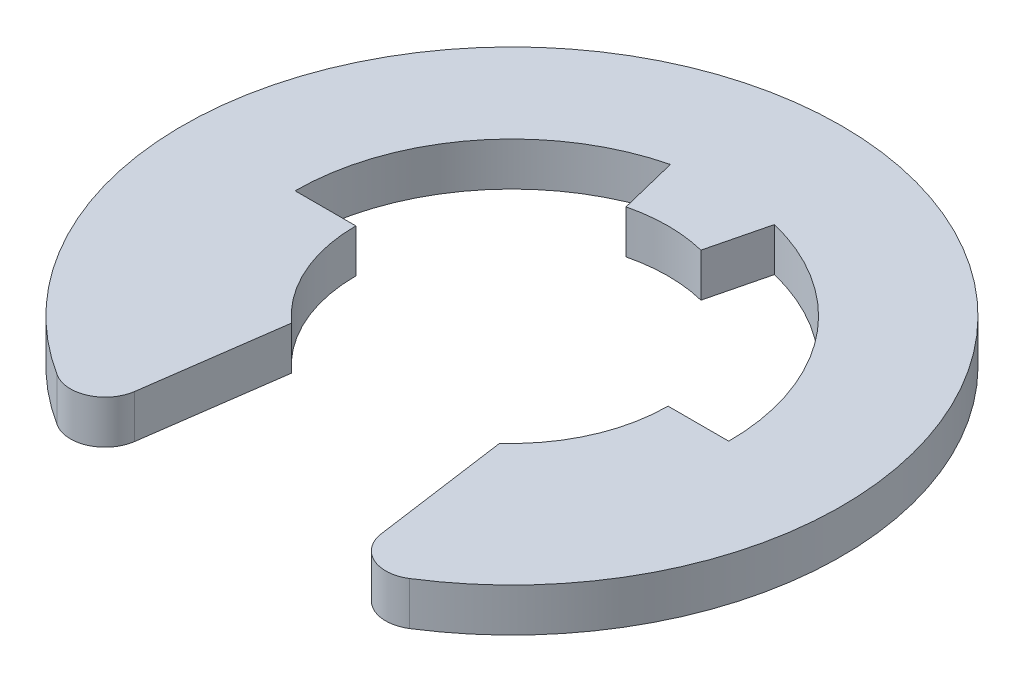
ISO-10303-21;
HEADER;
FILE_DESCRIPTION(('STEP AP214'),'2;1');
FILE_NAME('part.step','',(''),(''),'','','');
FILE_SCHEMA(('AUTOMOTIVE_DESIGN { 1 0 10303 214 1 1 1 1 }'));
ENDSEC;
DATA;
#1=APPLICATION_CONTEXT('core data for automotive mechanical design processes');
#2=APPLICATION_PROTOCOL_DEFINITION('international standard','automotive_design',2000,#1);
#3=PRODUCT_CONTEXT('',#1,'mechanical');
#4=PRODUCT('Part','Part','',(#3));
#5=PRODUCT_RELATED_PRODUCT_CATEGORY('part','',(#4));
#6=PRODUCT_DEFINITION_FORMATION('','',#4);
#7=PRODUCT_DEFINITION_CONTEXT('part definition',#1,'design');
#8=PRODUCT_DEFINITION('design','',#6,#7);
#9=PRODUCT_DEFINITION_SHAPE('','',#8);
#10=(LENGTH_UNIT() NAMED_UNIT(*) SI_UNIT(.MILLI.,.METRE.));
#11=(NAMED_UNIT(*) PLANE_ANGLE_UNIT() SI_UNIT($,.RADIAN.));
#12=(NAMED_UNIT(*) SI_UNIT($,.STERADIAN.) SOLID_ANGLE_UNIT());
#13=UNCERTAINTY_MEASURE_WITH_UNIT(LENGTH_MEASURE(1.E-05),#10,'distance_accuracy_value','');
#14=(GEOMETRIC_REPRESENTATION_CONTEXT(3) GLOBAL_UNCERTAINTY_ASSIGNED_CONTEXT((#13)) GLOBAL_UNIT_ASSIGNED_CONTEXT((#10,
#11,#12)) REPRESENTATION_CONTEXT('',''));
#15=CARTESIAN_POINT('',(0.,0.,0.));
#16=DIRECTION('',(0.,0.,1.));
#17=DIRECTION('',(1.,0.,0.));
#18=AXIS2_PLACEMENT_3D('',#15,#16,#17);
#19=CARTESIAN_POINT('',(0.,0.3175,0.));
#20=DIRECTION('',(0.,-1.,0.));
#21=DIRECTION('',(0.,0.,-1.));
#22=AXIS2_PLACEMENT_3D('',#19,#20,#21);
#23=CYLINDRICAL_SURFACE('',#22,2.286);
#24=CARTESIAN_POINT('',(0.,-0.3175,0.));
#25=DIRECTION('',(0.,-1.,0.));
#26=DIRECTION('',(0.,0.,1.));
#27=AXIS2_PLACEMENT_3D('',#24,#25,#26);
#28=CIRCLE('',#27,2.286);
#29=CARTESIAN_POINT('',(-1.524,-0.3175,1.70388379885484));
#30=VERTEX_POINT('',#29);
#31=CARTESIAN_POINT('',(-2.286,-0.3175,0.));
#32=VERTEX_POINT('',#31);
#33=EDGE_CURVE('E168',#30,#32,#28,.T.);
#34=ORIENTED_EDGE('',*,*,#33,.T.);
#35=DIRECTION('',(0.,-1.,0.));
#36=VECTOR('',#35,1.);
#37=CARTESIAN_POINT('',(-2.286,0.3175,0.));
#38=LINE('',#37,#36);
#39=CARTESIAN_POINT('',(-2.286,0.3175,0.));
#40=VERTEX_POINT('',#39);
#41=EDGE_CURVE('E151',#40,#32,#38,.T.);
#42=ORIENTED_EDGE('',*,*,#41,.F.);
#43=CARTESIAN_POINT('',(0.,0.3175,0.));
#44=DIRECTION('',(0.,-1.,0.));
#45=DIRECTION('',(0.,0.,1.));
#46=AXIS2_PLACEMENT_3D('',#43,#44,#45);
#47=CIRCLE('',#46,2.286);
#48=CARTESIAN_POINT('',(-1.524,0.3175,1.70388379885484));
#49=VERTEX_POINT('',#48);
#50=EDGE_CURVE('E157',#49,#40,#47,.T.);
#51=ORIENTED_EDGE('',*,*,#50,.F.);
#52=DIRECTION('',(0.,-1.,0.));
#53=VECTOR('',#52,1.);
#54=CARTESIAN_POINT('',(-1.524,0.3175,1.70388379885484));
#55=LINE('',#54,#53);
#56=EDGE_CURVE('E215',#49,#30,#55,.T.);
#57=ORIENTED_EDGE('',*,*,#56,.T.);
#58=EDGE_LOOP('',(#34,#42,#51,#57));
#59=FACE_BOUND('',#58,.T.);
#60=ADVANCED_FACE('F43',(#59),#23,.F.);
#61=CARTESIAN_POINT('',(-3.175,0.3175,0.));
#62=DIRECTION('',(0.,0.,1.));
#63=DIRECTION('',(1.,0.,0.));
#64=AXIS2_PLACEMENT_3D('',#61,#62,#63);
#65=PLANE('',#64);
#66=DIRECTION('',(-1.,0.,0.));
#67=VECTOR('',#66,1.);
#68=CARTESIAN_POINT('',(-3.175,-0.3175,0.));
#69=LINE('',#68,#67);
#70=CARTESIAN_POINT('',(-3.175,-0.3175,0.));
#71=VERTEX_POINT('',#70);
#72=EDGE_CURVE('E250',#32,#71,#69,.T.);
#73=ORIENTED_EDGE('',*,*,#72,.T.);
#74=DIRECTION('',(0.,-1.,0.));
#75=VECTOR('',#74,1.);
#76=CARTESIAN_POINT('',(-3.175,0.3175,0.));
#77=LINE('',#76,#75);
#78=CARTESIAN_POINT('',(-3.175,0.3175,0.));
#79=VERTEX_POINT('',#78);
#80=EDGE_CURVE('E154',#79,#71,#77,.T.);
#81=ORIENTED_EDGE('',*,*,#80,.F.);
#82=DIRECTION('',(-1.,0.,0.));
#83=VECTOR('',#82,1.);
#84=CARTESIAN_POINT('',(-3.175,0.3175,0.));
#85=LINE('',#84,#83);
#86=EDGE_CURVE('E147',#40,#79,#85,.T.);
#87=ORIENTED_EDGE('',*,*,#86,.F.);
#88=ORIENTED_EDGE('',*,*,#41,.T.);
#89=EDGE_LOOP('',(#73,#81,#87,#88));
#90=FACE_BOUND('',#89,.T.);
#91=ADVANCED_FACE('F149',(#90),#65,.F.);
#92=CARTESIAN_POINT('',(0.,0.3175,0.));
#93=DIRECTION('',(0.,-1.,0.));
#94=DIRECTION('',(0.,0.,-1.));
#95=AXIS2_PLACEMENT_3D('',#92,#93,#94);
#96=CYLINDRICAL_SURFACE('',#95,3.175);
#97=CARTESIAN_POINT('',(0.,-0.3175,0.));
#98=DIRECTION('',(0.,-1.,0.));
#99=DIRECTION('',(0.,0.,1.));
#100=AXIS2_PLACEMENT_3D('',#97,#98,#99);
#101=CIRCLE('',#100,3.175);
#102=CARTESIAN_POINT('',(-0.762,-0.3175,-3.08220391927595));
#103=VERTEX_POINT('',#102);
#104=EDGE_CURVE('E244',#71,#103,#101,.T.);
#105=ORIENTED_EDGE('',*,*,#104,.T.);
#106=DIRECTION('',(0.,-1.,0.));
#107=VECTOR('',#106,1.);
#108=CARTESIAN_POINT('',(-0.762,0.3175,-3.08220391927595));
#109=LINE('',#108,#107);
#110=CARTESIAN_POINT('',(-0.762,0.3175,-3.08220391927595));
#111=VERTEX_POINT('',#110);
#112=EDGE_CURVE('E173',#111,#103,#109,.T.);
#113=ORIENTED_EDGE('',*,*,#112,.F.);
#114=CARTESIAN_POINT('',(0.,0.3175,0.));
#115=DIRECTION('',(0.,-1.,0.));
#116=DIRECTION('',(0.,0.,1.));
#117=AXIS2_PLACEMENT_3D('',#114,#115,#116);
#118=CIRCLE('',#117,3.175);
#119=EDGE_CURVE('E156',#79,#111,#118,.T.);
#120=ORIENTED_EDGE('',*,*,#119,.F.);
#121=ORIENTED_EDGE('',*,*,#80,.T.);
#122=EDGE_LOOP('',(#105,#113,#120,#121));
#123=FACE_BOUND('',#122,.T.);
#124=ADVANCED_FACE('F275',(#123),#96,.F.);
#125=CARTESIAN_POINT('',(-0.762,0.3175,-3.08220391927595));
#126=DIRECTION('',(0.970772887960928,0.,-0.24));
#127=DIRECTION('',(-0.24,0.,-0.970772887960928));
#128=AXIS2_PLACEMENT_3D('',#125,#126,#127);
#129=PLANE('',#128);
#130=DIRECTION('',(0.24,0.,0.970772887960928));
#131=VECTOR('',#130,1.);
#132=CARTESIAN_POINT('',(-0.762,-0.3175,-3.08220391927595));
#133=LINE('',#132,#131);
#134=CARTESIAN_POINT('',(-0.54864,-0.3175,-2.21918682187868));
#135=VERTEX_POINT('',#134);
#136=EDGE_CURVE('E239',#103,#135,#133,.T.);
#137=ORIENTED_EDGE('',*,*,#136,.T.);
#138=DIRECTION('',(0.,-1.,0.));
#139=VECTOR('',#138,1.);
#140=CARTESIAN_POINT('',(-0.54864,0.3175,-2.21918682187868));
#141=LINE('',#140,#139);
#142=CARTESIAN_POINT('',(-0.54864,0.3175,-2.21918682187868));
#143=VERTEX_POINT('',#142);
#144=EDGE_CURVE('E230',#143,#135,#141,.T.);
#145=ORIENTED_EDGE('',*,*,#144,.F.);
#146=DIRECTION('',(0.24,0.,0.970772887960928));
#147=VECTOR('',#146,1.);
#148=CARTESIAN_POINT('',(-0.762,0.3175,-3.08220391927595));
#149=LINE('',#148,#147);
#150=EDGE_CURVE('E240',#111,#143,#149,.T.);
#151=ORIENTED_EDGE('',*,*,#150,.F.);
#152=ORIENTED_EDGE('',*,*,#112,.T.);
#153=EDGE_LOOP('',(#137,#145,#151,#152));
#154=FACE_BOUND('',#153,.T.);
#155=ADVANCED_FACE('F237',(#154),#129,.F.);
#156=CARTESIAN_POINT('',(0.,0.3175,0.));
#157=DIRECTION('',(0.,-1.,0.));
#158=DIRECTION('',(0.,0.,-1.));
#159=AXIS2_PLACEMENT_3D('',#156,#157,#158);
#160=CYLINDRICAL_SURFACE('',#159,2.286);
#161=CARTESIAN_POINT('',(0.,-0.3175,0.));
#162=DIRECTION('',(0.,-1.,0.));
#163=DIRECTION('',(0.,0.,1.));
#164=AXIS2_PLACEMENT_3D('',#161,#162,#163);
#165=CIRCLE('',#164,2.286);
#166=CARTESIAN_POINT('',(0.54864,-0.3175,-2.21918682187868));
#167=VERTEX_POINT('',#166);
#168=EDGE_CURVE('E246',#135,#167,#165,.T.);
#169=ORIENTED_EDGE('',*,*,#168,.T.);
#170=DIRECTION('',(0.,-1.,0.));
#171=VECTOR('',#170,1.);
#172=CARTESIAN_POINT('',(0.54864,0.3175,-2.21918682187868));
#173=LINE('',#172,#171);
#174=CARTESIAN_POINT('',(0.54864,0.3175,-2.21918682187868));
#175=VERTEX_POINT('',#174);
#176=EDGE_CURVE('E227',#175,#167,#173,.T.);
#177=ORIENTED_EDGE('',*,*,#176,.F.);
#178=CARTESIAN_POINT('',(0.,0.3175,0.));
#179=DIRECTION('',(0.,-1.,0.));
#180=DIRECTION('',(0.,0.,1.));
#181=AXIS2_PLACEMENT_3D('',#178,#179,#180);
#182=CIRCLE('',#181,2.286);
#183=EDGE_CURVE('E277',#143,#175,#182,.T.);
#184=ORIENTED_EDGE('',*,*,#183,.F.);
#185=ORIENTED_EDGE('',*,*,#144,.T.);
#186=EDGE_LOOP('',(#169,#177,#184,#185));
#187=FACE_BOUND('',#186,.T.);
#188=ADVANCED_FACE('F292',(#187),#160,.F.);
#189=CARTESIAN_POINT('',(0.762,0.3175,-3.08220391927595));
#190=DIRECTION('',(-0.970772887960928,0.,-0.24));
#191=DIRECTION('',(-0.24,0.,0.970772887960928));
#192=AXIS2_PLACEMENT_3D('',#189,#190,#191);
#193=PLANE('',#192);
#194=DIRECTION('',(0.24,0.,-0.970772887960928));
#195=VECTOR('',#194,1.);
#196=CARTESIAN_POINT('',(0.762,-0.3175,-3.08220391927595));
#197=LINE('',#196,#195);
#198=CARTESIAN_POINT('',(0.762,-0.3175,-3.08220391927595));
#199=VERTEX_POINT('',#198);
#200=EDGE_CURVE('E248',#167,#199,#197,.T.);
#201=ORIENTED_EDGE('',*,*,#200,.T.);
#202=DIRECTION('',(0.,-1.,0.));
#203=VECTOR('',#202,1.);
#204=CARTESIAN_POINT('',(0.762,0.3175,-3.08220391927595));
#205=LINE('',#204,#203);
#206=CARTESIAN_POINT('',(0.762,0.3175,-3.08220391927595));
#207=VERTEX_POINT('',#206);
#208=EDGE_CURVE('E224',#207,#199,#205,.T.);
#209=ORIENTED_EDGE('',*,*,#208,.F.);
#210=DIRECTION('',(0.24,0.,-0.970772887960928));
#211=VECTOR('',#210,1.);
#212=CARTESIAN_POINT('',(0.762,0.3175,-3.08220391927595));
#213=LINE('',#212,#211);
#214=EDGE_CURVE('E281',#175,#207,#213,.T.);
#215=ORIENTED_EDGE('',*,*,#214,.F.);
#216=ORIENTED_EDGE('',*,*,#176,.T.);
#217=EDGE_LOOP('',(#201,#209,#215,#216));
#218=FACE_BOUND('',#217,.T.);
#219=ADVANCED_FACE('F288',(#218),#193,.F.);
#220=CARTESIAN_POINT('',(0.,0.3175,0.));
#221=DIRECTION('',(0.,-1.,0.));
#222=DIRECTION('',(0.,0.,-1.));
#223=AXIS2_PLACEMENT_3D('',#220,#221,#222);
#224=CYLINDRICAL_SURFACE('',#223,3.175);
#225=CARTESIAN_POINT('',(0.,-0.3175,0.));
#226=DIRECTION('',(0.,-1.,0.));
#227=DIRECTION('',(0.,0.,1.));
#228=AXIS2_PLACEMENT_3D('',#225,#226,#227);
#229=CIRCLE('',#228,3.175);
#230=CARTESIAN_POINT('',(3.175,-0.3175,0.));
#231=VERTEX_POINT('',#230);
#232=EDGE_CURVE('E255',#199,#231,#229,.T.);
#233=ORIENTED_EDGE('',*,*,#232,.T.);
#234=DIRECTION('',(0.,-1.,0.));
#235=VECTOR('',#234,1.);
#236=CARTESIAN_POINT('',(3.175,0.3175,0.));
#237=LINE('',#236,#235);
#238=CARTESIAN_POINT('',(3.175,0.3175,0.));
#239=VERTEX_POINT('',#238);
#240=EDGE_CURVE('E221',#239,#231,#237,.T.);
#241=ORIENTED_EDGE('',*,*,#240,.F.);
#242=CARTESIAN_POINT('',(0.,0.3175,0.));
#243=DIRECTION('',(0.,-1.,0.));
#244=DIRECTION('',(0.,0.,1.));
#245=AXIS2_PLACEMENT_3D('',#242,#243,#244);
#246=CIRCLE('',#245,3.175);
#247=EDGE_CURVE('E270',#207,#239,#246,.T.);
#248=ORIENTED_EDGE('',*,*,#247,.F.);
#249=ORIENTED_EDGE('',*,*,#208,.T.);
#250=EDGE_LOOP('',(#233,#241,#248,#249));
#251=FACE_BOUND('',#250,.T.);
#252=ADVANCED_FACE('F286',(#251),#224,.F.);
#253=CARTESIAN_POINT('',(2.286,0.3175,0.));
#254=DIRECTION('',(0.,0.,1.));
#255=DIRECTION('',(1.,0.,0.));
#256=AXIS2_PLACEMENT_3D('',#253,#254,#255);
#257=PLANE('',#256);
#258=DIRECTION('',(-1.,0.,0.));
#259=VECTOR('',#258,1.);
#260=CARTESIAN_POINT('',(2.286,-0.3175,0.));
#261=LINE('',#260,#259);
#262=CARTESIAN_POINT('',(2.286,-0.3175,0.));
#263=VERTEX_POINT('',#262);
#264=EDGE_CURVE('E210',#231,#263,#261,.T.);
#265=ORIENTED_EDGE('',*,*,#264,.T.);
#266=DIRECTION('',(0.,-1.,0.));
#267=VECTOR('',#266,1.);
#268=CARTESIAN_POINT('',(2.286,0.3175,0.));
#269=LINE('',#268,#267);
#270=CARTESIAN_POINT('',(2.286,0.3175,0.));
#271=VERTEX_POINT('',#270);
#272=EDGE_CURVE('E218',#271,#263,#269,.T.);
#273=ORIENTED_EDGE('',*,*,#272,.F.);
#274=DIRECTION('',(-1.,0.,0.));
#275=VECTOR('',#274,1.);
#276=CARTESIAN_POINT('',(2.286,0.3175,0.));
#277=LINE('',#276,#275);
#278=EDGE_CURVE('E267',#239,#271,#277,.T.);
#279=ORIENTED_EDGE('',*,*,#278,.F.);
#280=ORIENTED_EDGE('',*,*,#240,.T.);
#281=EDGE_LOOP('',(#265,#273,#279,#280));
#282=FACE_BOUND('',#281,.T.);
#283=ADVANCED_FACE('F259',(#282),#257,.F.);
#284=CARTESIAN_POINT('',(0.,0.3175,0.));
#285=DIRECTION('',(0.,-1.,0.));
#286=DIRECTION('',(0.,0.,-1.));
#287=AXIS2_PLACEMENT_3D('',#284,#285,#286);
#288=CYLINDRICAL_SURFACE('',#287,2.286);
#289=CARTESIAN_POINT('',(0.,-0.3175,0.));
#290=DIRECTION('',(0.,-1.,0.));
#291=DIRECTION('',(0.,0.,1.));
#292=AXIS2_PLACEMENT_3D('',#289,#290,#291);
#293=CIRCLE('',#292,2.286);
#294=CARTESIAN_POINT('',(1.52400000000001,-0.3175,1.70388379885484));
#295=VERTEX_POINT('',#294);
#296=EDGE_CURVE('E207',#263,#295,#293,.T.);
#297=ORIENTED_EDGE('',*,*,#296,.T.);
#298=DIRECTION('',(0.,-1.,0.));
#299=VECTOR('',#298,1.);
#300=CARTESIAN_POINT('',(1.52400000000001,0.3175,1.70388379885484));
#301=LINE('',#300,#299);
#302=CARTESIAN_POINT('',(1.52400000000001,0.3175,1.70388379885484));
#303=VERTEX_POINT('',#302);
#304=EDGE_CURVE('E206',#303,#295,#301,.T.);
#305=ORIENTED_EDGE('',*,*,#304,.F.);
#306=CARTESIAN_POINT('',(0.,0.3175,0.));
#307=DIRECTION('',(0.,-1.,0.));
#308=DIRECTION('',(0.,0.,1.));
#309=AXIS2_PLACEMENT_3D('',#306,#307,#308);
#310=CIRCLE('',#309,2.286);
#311=EDGE_CURVE('E266',#271,#303,#310,.T.);
#312=ORIENTED_EDGE('',*,*,#311,.F.);
#313=ORIENTED_EDGE('',*,*,#272,.T.);
#314=EDGE_LOOP('',(#297,#305,#312,#313));
#315=FACE_BOUND('',#314,.T.);
#316=ADVANCED_FACE('F265',(#315),#288,.F.);
#317=CARTESIAN_POINT('',(1.905,0.3175,4.43410092352441));
#318=DIRECTION('',(0.990402935514642,0.,-0.138210076781617));
#319=DIRECTION('',(-0.138210076781617,0.,-0.990402935514642));
#320=AXIS2_PLACEMENT_3D('',#317,#318,#319);
#321=PLANE('',#320);
#322=DIRECTION('',(0.138210076781617,0.,0.990402935514642));
#323=VECTOR('',#322,1.);
#324=CARTESIAN_POINT('',(1.905,-0.3175,4.43410092352441));
#325=LINE('',#324,#323);
#326=CARTESIAN_POINT('',(1.80526190931265,-0.3175,3.71938532463609));
#327=VERTEX_POINT('',#326);
#328=EDGE_CURVE('E201',#295,#327,#325,.T.);
#329=ORIENTED_EDGE('',*,*,#328,.T.);
#330=DIRECTION('',(0.,-1.,0.));
#331=VECTOR('',#330,1.);
#332=CARTESIAN_POINT('',(1.80526190931265,0.3175,3.71938532463609));
#333=LINE('',#332,#331);
#334=CARTESIAN_POINT('',(1.80526190931265,0.3175,3.71938532463609));
#335=VERTEX_POINT('',#334);
#336=EDGE_CURVE('E66',#327,#335,#333,.F.);
#337=ORIENTED_EDGE('',*,*,#336,.T.);
#338=DIRECTION('',(0.138210076781617,0.,0.990402935514642));
#339=VECTOR('',#338,1.);
#340=CARTESIAN_POINT('',(1.905,0.3175,4.43410092352441));
#341=LINE('',#340,#339);
#342=EDGE_CURVE('E187',#303,#335,#341,.T.);
#343=ORIENTED_EDGE('',*,*,#342,.F.);
#344=ORIENTED_EDGE('',*,*,#304,.T.);
#345=EDGE_LOOP('',(#329,#337,#343,#344));
#346=FACE_BOUND('',#345,.T.);
#347=ADVANCED_FACE('F204',(#346),#321,.F.);
#348=CARTESIAN_POINT('',(0.,0.3175,0.));
#349=DIRECTION('',(0.,-1.,0.));
#350=DIRECTION('',(0.,0.,-1.));
#351=AXIS2_PLACEMENT_3D('',#348,#349,#350);
#352=CYLINDRICAL_SURFACE('',#351,4.826);
#353=CARTESIAN_POINT('',(0.,0.3175,0.));
#354=DIRECTION('',(0.,1.,0.));
#355=DIRECTION('',(0.,0.,1.));
#356=AXIS2_PLACEMENT_3D('',#353,#354,#355);
#357=CIRCLE('',#356,4.826);
#358=CARTESIAN_POINT('',(2.57996149473693,0.3175,4.07848926511703));
#359=VERTEX_POINT('',#358);
#360=CARTESIAN_POINT('',(-2.57996149473692,0.3175,4.07848926511703));
#361=VERTEX_POINT('',#360);
#362=EDGE_CURVE('E186',#359,#361,#357,.T.);
#363=ORIENTED_EDGE('',*,*,#362,.F.);
#364=DIRECTION('',(0.,-1.,0.));
#365=VECTOR('',#364,1.);
#366=CARTESIAN_POINT('',(2.57996149473693,0.3175,4.07848926511703));
#367=LINE('',#366,#365);
#368=CARTESIAN_POINT('',(2.57996149473693,-0.3175,4.07848926511703));
#369=VERTEX_POINT('',#368);
#370=EDGE_CURVE('E171',#359,#369,#367,.T.);
#371=ORIENTED_EDGE('',*,*,#370,.T.);
#372=CARTESIAN_POINT('',(0.,-0.3175,0.));
#373=DIRECTION('',(0.,1.,0.));
#374=DIRECTION('',(0.,0.,1.));
#375=AXIS2_PLACEMENT_3D('',#372,#373,#374);
#376=CIRCLE('',#375,4.826);
#377=CARTESIAN_POINT('',(-2.57996149473692,-0.3175,4.07848926511703));
#378=VERTEX_POINT('',#377);
#379=EDGE_CURVE('E202',#369,#378,#376,.T.);
#380=ORIENTED_EDGE('',*,*,#379,.T.);
#381=DIRECTION('',(0.,-1.,0.));
#382=VECTOR('',#381,1.);
#383=CARTESIAN_POINT('',(-2.57996149473692,0.3175,4.07848926511703));
#384=LINE('',#383,#382);
#385=EDGE_CURVE('E169',#378,#361,#384,.F.);
#386=ORIENTED_EDGE('',*,*,#385,.T.);
#387=EDGE_LOOP('',(#363,#371,#380,#386));
#388=FACE_BOUND('',#387,.T.);
#389=ADVANCED_FACE('F191',(#388),#352,.T.);
#390=CARTESIAN_POINT('',(-1.905,0.3175,4.43410092352441));
#391=DIRECTION('',(-0.990402935514641,0.,-0.138210076781621));
#392=DIRECTION('',(-0.138210076781621,0.,0.990402935514641));
#393=AXIS2_PLACEMENT_3D('',#390,#391,#392);
#394=PLANE('',#393);
#395=DIRECTION('',(0.138210076781621,0.,-0.990402935514641));
#396=VECTOR('',#395,1.);
#397=CARTESIAN_POINT('',(-1.905,0.3175,4.43410092352441));
#398=LINE('',#397,#396);
#399=CARTESIAN_POINT('',(-1.80526190931265,0.3175,3.71938532463609));
#400=VERTEX_POINT('',#399);
#401=EDGE_CURVE('E161',#400,#49,#398,.T.);
#402=ORIENTED_EDGE('',*,*,#401,.F.);
#403=DIRECTION('',(0.,-1.,0.));
#404=VECTOR('',#403,1.);
#405=CARTESIAN_POINT('',(-1.80526190931265,0.3175,3.71938532463609));
#406=LINE('',#405,#404);
#407=CARTESIAN_POINT('',(-1.80526190931265,-0.3175,3.71938532463609));
#408=VERTEX_POINT('',#407);
#409=EDGE_CURVE('E11',#400,#408,#406,.T.);
#410=ORIENTED_EDGE('',*,*,#409,.T.);
#411=DIRECTION('',(0.138210076781621,0.,-0.990402935514641));
#412=VECTOR('',#411,1.);
#413=CARTESIAN_POINT('',(-1.905,-0.3175,4.43410092352441));
#414=LINE('',#413,#412);
#415=EDGE_CURVE('E165',#408,#30,#414,.T.);
#416=ORIENTED_EDGE('',*,*,#415,.T.);
#417=ORIENTED_EDGE('',*,*,#56,.F.);
#418=EDGE_LOOP('',(#402,#410,#416,#417));
#419=FACE_BOUND('',#418,.T.);
#420=ADVANCED_FACE('F318',(#419),#394,.F.);
#421=CARTESIAN_POINT('',(0.,0.3175,0.));
#422=DIRECTION('',(0.,1.,0.));
#423=DIRECTION('',(0.,0.,1.));
#424=AXIS2_PLACEMENT_3D('',#421,#422,#423);
#425=PLANE('',#424);
#426=ORIENTED_EDGE('',*,*,#342,.T.);
#427=CARTESIAN_POINT('',(2.30838660055409,0.3175,3.64917460563102));
#428=DIRECTION('',(0.,1.,0.));
#429=DIRECTION('',(0.,0.,1.));
#430=AXIS2_PLACEMENT_3D('',#427,#428,#429);
#431=CIRCLE('',#430,0.508);
#432=EDGE_CURVE('E51',#335,#359,#431,.T.);
#433=ORIENTED_EDGE('',*,*,#432,.T.);
#434=ORIENTED_EDGE('',*,*,#362,.T.);
#435=CARTESIAN_POINT('',(-2.30838660055409,0.3175,3.64917460563103));
#436=DIRECTION('',(0.,1.,0.));
#437=DIRECTION('',(0.,0.,1.));
#438=AXIS2_PLACEMENT_3D('',#435,#436,#437);
#439=CIRCLE('',#438,0.508);
#440=EDGE_CURVE('E58',#361,#400,#439,.T.);
#441=ORIENTED_EDGE('',*,*,#440,.T.);
#442=ORIENTED_EDGE('',*,*,#401,.T.);
#443=ORIENTED_EDGE('',*,*,#50,.T.);
#444=ORIENTED_EDGE('',*,*,#86,.T.);
#445=ORIENTED_EDGE('',*,*,#119,.T.);
#446=ORIENTED_EDGE('',*,*,#150,.T.);
#447=ORIENTED_EDGE('',*,*,#183,.T.);
#448=ORIENTED_EDGE('',*,*,#214,.T.);
#449=ORIENTED_EDGE('',*,*,#247,.T.);
#450=ORIENTED_EDGE('',*,*,#278,.T.);
#451=ORIENTED_EDGE('',*,*,#311,.T.);
#452=EDGE_LOOP('',(#426,#433,#434,#441,#442,#443,#444,#445,#446,#447,#448,#449,#450,#451));
#453=FACE_BOUND('',#452,.T.);
#454=ADVANCED_FACE('F160',(#453),#425,.T.);
#455=CARTESIAN_POINT('',(0.,-0.3175,0.));
#456=DIRECTION('',(0.,1.,0.));
#457=DIRECTION('',(0.,0.,1.));
#458=AXIS2_PLACEMENT_3D('',#455,#456,#457);
#459=PLANE('',#458);
#460=ORIENTED_EDGE('',*,*,#379,.F.);
#461=CARTESIAN_POINT('',(2.30838660055409,-0.3175,3.64917460563102));
#462=DIRECTION('',(0.,1.,0.));
#463=DIRECTION('',(0.,0.,1.));
#464=AXIS2_PLACEMENT_3D('',#461,#462,#463);
#465=CIRCLE('',#464,0.508);
#466=EDGE_CURVE('E181',#369,#327,#465,.F.);
#467=ORIENTED_EDGE('',*,*,#466,.T.);
#468=ORIENTED_EDGE('',*,*,#328,.F.);
#469=ORIENTED_EDGE('',*,*,#296,.F.);
#470=ORIENTED_EDGE('',*,*,#264,.F.);
#471=ORIENTED_EDGE('',*,*,#232,.F.);
#472=ORIENTED_EDGE('',*,*,#200,.F.);
#473=ORIENTED_EDGE('',*,*,#168,.F.);
#474=ORIENTED_EDGE('',*,*,#136,.F.);
#475=ORIENTED_EDGE('',*,*,#104,.F.);
#476=ORIENTED_EDGE('',*,*,#72,.F.);
#477=ORIENTED_EDGE('',*,*,#33,.F.);
#478=ORIENTED_EDGE('',*,*,#415,.F.);
#479=CARTESIAN_POINT('',(-2.30838660055409,-0.3175,3.64917460563103));
#480=DIRECTION('',(0.,1.,0.));
#481=DIRECTION('',(0.,0.,1.));
#482=AXIS2_PLACEMENT_3D('',#479,#480,#481);
#483=CIRCLE('',#482,0.508);
#484=EDGE_CURVE('E179',#408,#378,#483,.F.);
#485=ORIENTED_EDGE('',*,*,#484,.T.);
#486=EDGE_LOOP('',(#460,#467,#468,#469,#470,#471,#472,#473,#474,#475,#476,#477,#478,#485));
#487=FACE_BOUND('',#486,.T.);
#488=ADVANCED_FACE('F199',(#487),#459,.F.);
#489=CARTESIAN_POINT('',(2.30838660055409,0.3175,3.64917460563102));
#490=DIRECTION('',(0.,-1.,0.));
#491=DIRECTION('',(0.,0.,-1.));
#492=AXIS2_PLACEMENT_3D('',#489,#490,#491);
#493=CYLINDRICAL_SURFACE('',#492,0.508);
#494=ORIENTED_EDGE('',*,*,#432,.F.);
#495=ORIENTED_EDGE('',*,*,#336,.F.);
#496=ORIENTED_EDGE('',*,*,#466,.F.);
#497=ORIENTED_EDGE('',*,*,#370,.F.);
#498=EDGE_LOOP('',(#494,#495,#496,#497));
#499=FACE_BOUND('',#498,.T.);
#500=ADVANCED_FACE('F196',(#499),#493,.T.);
#501=CARTESIAN_POINT('',(-2.30838660055409,0.3175,3.64917460563103));
#502=DIRECTION('',(0.,-1.,0.));
#503=DIRECTION('',(0.,0.,-1.));
#504=AXIS2_PLACEMENT_3D('',#501,#502,#503);
#505=CYLINDRICAL_SURFACE('',#504,0.508);
#506=ORIENTED_EDGE('',*,*,#440,.F.);
#507=ORIENTED_EDGE('',*,*,#385,.F.);
#508=ORIENTED_EDGE('',*,*,#484,.F.);
#509=ORIENTED_EDGE('',*,*,#409,.F.);
#510=EDGE_LOOP('',(#506,#507,#508,#509));
#511=FACE_BOUND('',#510,.T.);
#512=ADVANCED_FACE('F45',(#511),#505,.T.);
#513=CLOSED_SHELL('',(#60,#91,#124,#155,#188,#219,#252,#283,#316,#347,#389,#420,#454,#488,#500,#512));
#514=MANIFOLD_SOLID_BREP('B2',#513);
#515=ADVANCED_BREP_SHAPE_REPRESENTATION('',(#18,#514),#14);
#516=SHAPE_DEFINITION_REPRESENTATION(#9,#515);
ENDSEC;
END-ISO-10303-21;
